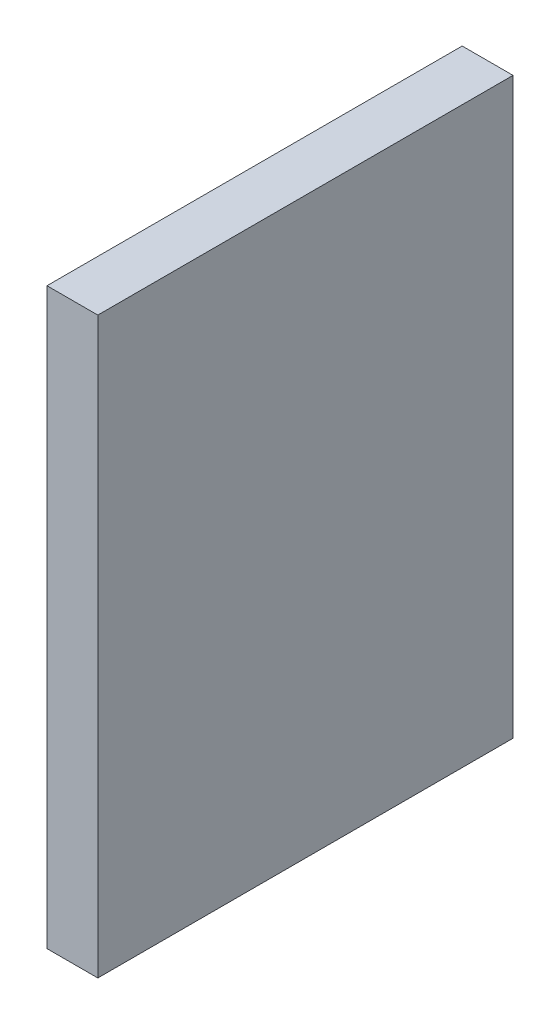
ISO-10303-21;
HEADER;
FILE_DESCRIPTION(('STEP AP214'),'2;1');
FILE_NAME('part.step','',(''),(''),'','','');
FILE_SCHEMA(('AUTOMOTIVE_DESIGN { 1 0 10303 214 1 1 1 1 }'));
ENDSEC;
DATA;
#1=APPLICATION_CONTEXT('core data for automotive mechanical design processes');
#2=APPLICATION_PROTOCOL_DEFINITION('international standard','automotive_design',2000,#1);
#3=PRODUCT_CONTEXT('',#1,'mechanical');
#4=PRODUCT('Part','Part','',(#3));
#5=PRODUCT_RELATED_PRODUCT_CATEGORY('part','',(#4));
#6=PRODUCT_DEFINITION_FORMATION('','',#4);
#7=PRODUCT_DEFINITION_CONTEXT('part definition',#1,'design');
#8=PRODUCT_DEFINITION('design','',#6,#7);
#9=PRODUCT_DEFINITION_SHAPE('','',#8);
#10=(LENGTH_UNIT() NAMED_UNIT(*) SI_UNIT(.MILLI.,.METRE.));
#11=(NAMED_UNIT(*) PLANE_ANGLE_UNIT() SI_UNIT($,.RADIAN.));
#12=(NAMED_UNIT(*) SI_UNIT($,.STERADIAN.) SOLID_ANGLE_UNIT());
#13=UNCERTAINTY_MEASURE_WITH_UNIT(LENGTH_MEASURE(1.E-05),#10,'distance_accuracy_value','');
#14=(GEOMETRIC_REPRESENTATION_CONTEXT(3) GLOBAL_UNCERTAINTY_ASSIGNED_CONTEXT((#13)) GLOBAL_UNIT_ASSIGNED_CONTEXT((#10,
#11,#12)) REPRESENTATION_CONTEXT('',''));
#15=CARTESIAN_POINT('',(0.,0.,0.));
#16=DIRECTION('',(0.,0.,1.));
#17=DIRECTION('',(1.,0.,0.));
#18=AXIS2_PLACEMENT_3D('',#15,#16,#17);
#19=CARTESIAN_POINT('',(3.,-56.7136635749748,-41.0383830188961));
#20=DIRECTION('',(0.,0.,1.));
#21=DIRECTION('',(1.,0.,0.));
#22=AXIS2_PLACEMENT_3D('',#19,#20,#21);
#23=PLANE('',#22);
#24=DIRECTION('',(0.,1.,0.));
#25=VECTOR('',#24,1.);
#26=CARTESIAN_POINT('',(0.,-56.7136635749748,-41.0383830188961));
#27=LINE('',#26,#25);
#28=CARTESIAN_POINT('',(0.,-56.7136635749748,-41.0383830188961));
#29=VERTEX_POINT('',#28);
#30=CARTESIAN_POINT('',(0.,-22.8366987069379,-41.0383830188961));
#31=VERTEX_POINT('',#30);
#32=EDGE_CURVE('E96',#29,#31,#27,.T.);
#33=ORIENTED_EDGE('',*,*,#32,.T.);
#34=DIRECTION('',(-1.,0.,0.));
#35=VECTOR('',#34,1.);
#36=CARTESIAN_POINT('',(3.,-22.8366987069379,-41.0383830188961));
#37=LINE('',#36,#35);
#38=CARTESIAN_POINT('',(3.,-22.8366987069379,-41.0383830188961));
#39=VERTEX_POINT('',#38);
#40=EDGE_CURVE('E11',#39,#31,#37,.T.);
#41=ORIENTED_EDGE('',*,*,#40,.F.);
#42=DIRECTION('',(0.,1.,0.));
#43=VECTOR('',#42,1.);
#44=CARTESIAN_POINT('',(3.,-56.7136635749748,-41.0383830188961));
#45=LINE('',#44,#43);
#46=CARTESIAN_POINT('',(3.,-56.7136635749748,-41.0383830188961));
#47=VERTEX_POINT('',#46);
#48=EDGE_CURVE('E84',#47,#39,#45,.T.);
#49=ORIENTED_EDGE('',*,*,#48,.F.);
#50=DIRECTION('',(-1.,0.,0.));
#51=VECTOR('',#50,1.);
#52=CARTESIAN_POINT('',(3.,-56.7136635749748,-41.0383830188961));
#53=LINE('',#52,#51);
#54=EDGE_CURVE('E92',#47,#29,#53,.T.);
#55=ORIENTED_EDGE('',*,*,#54,.T.);
#56=EDGE_LOOP('',(#33,#41,#49,#55));
#57=FACE_BOUND('',#56,.T.);
#58=ADVANCED_FACE('F33',(#57),#23,.F.);
#59=CARTESIAN_POINT('',(3.,-22.8366987069379,-16.538383018896));
#60=DIRECTION('',(0.,-1.,0.));
#61=DIRECTION('',(0.,0.,-1.));
#62=AXIS2_PLACEMENT_3D('',#59,#60,#61);
#63=PLANE('',#62);
#64=DIRECTION('',(0.,0.,1.));
#65=VECTOR('',#64,1.);
#66=CARTESIAN_POINT('',(0.,-22.8366987069379,-16.538383018896));
#67=LINE('',#66,#65);
#68=CARTESIAN_POINT('',(0.,-22.8366987069379,-16.538383018896));
#69=VERTEX_POINT('',#68);
#70=EDGE_CURVE('E88',#31,#69,#67,.T.);
#71=ORIENTED_EDGE('',*,*,#70,.T.);
#72=DIRECTION('',(-1.,0.,0.));
#73=VECTOR('',#72,1.);
#74=CARTESIAN_POINT('',(3.,-22.8366987069379,-16.538383018896));
#75=LINE('',#74,#73);
#76=CARTESIAN_POINT('',(3.,-22.8366987069379,-16.538383018896));
#77=VERTEX_POINT('',#76);
#78=EDGE_CURVE('E41',#77,#69,#75,.T.);
#79=ORIENTED_EDGE('',*,*,#78,.F.);
#80=DIRECTION('',(0.,0.,1.));
#81=VECTOR('',#80,1.);
#82=CARTESIAN_POINT('',(3.,-22.8366987069379,-16.538383018896));
#83=LINE('',#82,#81);
#84=EDGE_CURVE('E79',#39,#77,#83,.T.);
#85=ORIENTED_EDGE('',*,*,#84,.F.);
#86=ORIENTED_EDGE('',*,*,#40,.T.);
#87=EDGE_LOOP('',(#71,#79,#85,#86));
#88=FACE_BOUND('',#87,.T.);
#89=ADVANCED_FACE('F87',(#88),#63,.F.);
#90=CARTESIAN_POINT('',(3.,-56.7136635749748,-16.538383018896));
#91=DIRECTION('',(0.,0.,-1.));
#92=DIRECTION('',(-1.,0.,0.));
#93=AXIS2_PLACEMENT_3D('',#90,#91,#92);
#94=PLANE('',#93);
#95=DIRECTION('',(0.,-1.,0.));
#96=VECTOR('',#95,1.);
#97=CARTESIAN_POINT('',(0.,-56.7136635749748,-16.538383018896));
#98=LINE('',#97,#96);
#99=CARTESIAN_POINT('',(0.,-56.7136635749748,-16.538383018896));
#100=VERTEX_POINT('',#99);
#101=EDGE_CURVE('E66',#69,#100,#98,.T.);
#102=ORIENTED_EDGE('',*,*,#101,.T.);
#103=DIRECTION('',(-1.,0.,0.));
#104=VECTOR('',#103,1.);
#105=CARTESIAN_POINT('',(3.,-56.7136635749748,-16.538383018896));
#106=LINE('',#105,#104);
#107=CARTESIAN_POINT('',(3.,-56.7136635749748,-16.538383018896));
#108=VERTEX_POINT('',#107);
#109=EDGE_CURVE('E89',#108,#100,#106,.T.);
#110=ORIENTED_EDGE('',*,*,#109,.F.);
#111=DIRECTION('',(0.,-1.,0.));
#112=VECTOR('',#111,1.);
#113=CARTESIAN_POINT('',(3.,-56.7136635749748,-16.538383018896));
#114=LINE('',#113,#112);
#115=EDGE_CURVE('E82',#77,#108,#114,.T.);
#116=ORIENTED_EDGE('',*,*,#115,.F.);
#117=ORIENTED_EDGE('',*,*,#78,.T.);
#118=EDGE_LOOP('',(#102,#110,#116,#117));
#119=FACE_BOUND('',#118,.T.);
#120=ADVANCED_FACE('F90',(#119),#94,.F.);
#121=CARTESIAN_POINT('',(3.,-56.7136635749748,-16.538383018896));
#122=DIRECTION('',(0.,1.,0.));
#123=DIRECTION('',(0.,0.,1.));
#124=AXIS2_PLACEMENT_3D('',#121,#122,#123);
#125=PLANE('',#124);
#126=DIRECTION('',(0.,0.,-1.));
#127=VECTOR('',#126,1.);
#128=CARTESIAN_POINT('',(0.,-56.7136635749748,-16.538383018896));
#129=LINE('',#128,#127);
#130=EDGE_CURVE('E72',#100,#29,#129,.T.);
#131=ORIENTED_EDGE('',*,*,#130,.T.);
#132=ORIENTED_EDGE('',*,*,#54,.F.);
#133=DIRECTION('',(0.,0.,-1.));
#134=VECTOR('',#133,1.);
#135=CARTESIAN_POINT('',(3.,-56.7136635749748,-16.538383018896));
#136=LINE('',#135,#134);
#137=EDGE_CURVE('E49',#108,#47,#136,.T.);
#138=ORIENTED_EDGE('',*,*,#137,.F.);
#139=ORIENTED_EDGE('',*,*,#109,.T.);
#140=EDGE_LOOP('',(#131,#132,#138,#139));
#141=FACE_BOUND('',#140,.T.);
#142=ADVANCED_FACE('F103',(#141),#125,.F.);
#143=CARTESIAN_POINT('',(3.,0.,0.));
#144=DIRECTION('',(-1.,0.,0.));
#145=DIRECTION('',(0.,0.,1.));
#146=AXIS2_PLACEMENT_3D('',#143,#144,#145);
#147=PLANE('',#146);
#148=ORIENTED_EDGE('',*,*,#48,.T.);
#149=ORIENTED_EDGE('',*,*,#84,.T.);
#150=ORIENTED_EDGE('',*,*,#115,.T.);
#151=ORIENTED_EDGE('',*,*,#137,.T.);
#152=EDGE_LOOP('',(#148,#149,#150,#151));
#153=FACE_BOUND('',#152,.T.);
#154=ADVANCED_FACE('F80',(#153),#147,.F.);
#155=CARTESIAN_POINT('',(0.,0.,0.));
#156=DIRECTION('',(-1.,0.,0.));
#157=DIRECTION('',(0.,0.,1.));
#158=AXIS2_PLACEMENT_3D('',#155,#156,#157);
#159=PLANE('',#158);
#160=ORIENTED_EDGE('',*,*,#32,.F.);
#161=ORIENTED_EDGE('',*,*,#130,.F.);
#162=ORIENTED_EDGE('',*,*,#101,.F.);
#163=ORIENTED_EDGE('',*,*,#70,.F.);
#164=EDGE_LOOP('',(#160,#161,#162,#163));
#165=FACE_BOUND('',#164,.T.);
#166=ADVANCED_FACE('F106',(#165),#159,.T.);
#167=CLOSED_SHELL('',(#58,#89,#120,#142,#154,#166));
#168=MANIFOLD_SOLID_BREP('B2',#167);
#169=ADVANCED_BREP_SHAPE_REPRESENTATION('',(#18,#168),#14);
#170=SHAPE_DEFINITION_REPRESENTATION(#9,#169);
ENDSEC;
END-ISO-10303-21;
